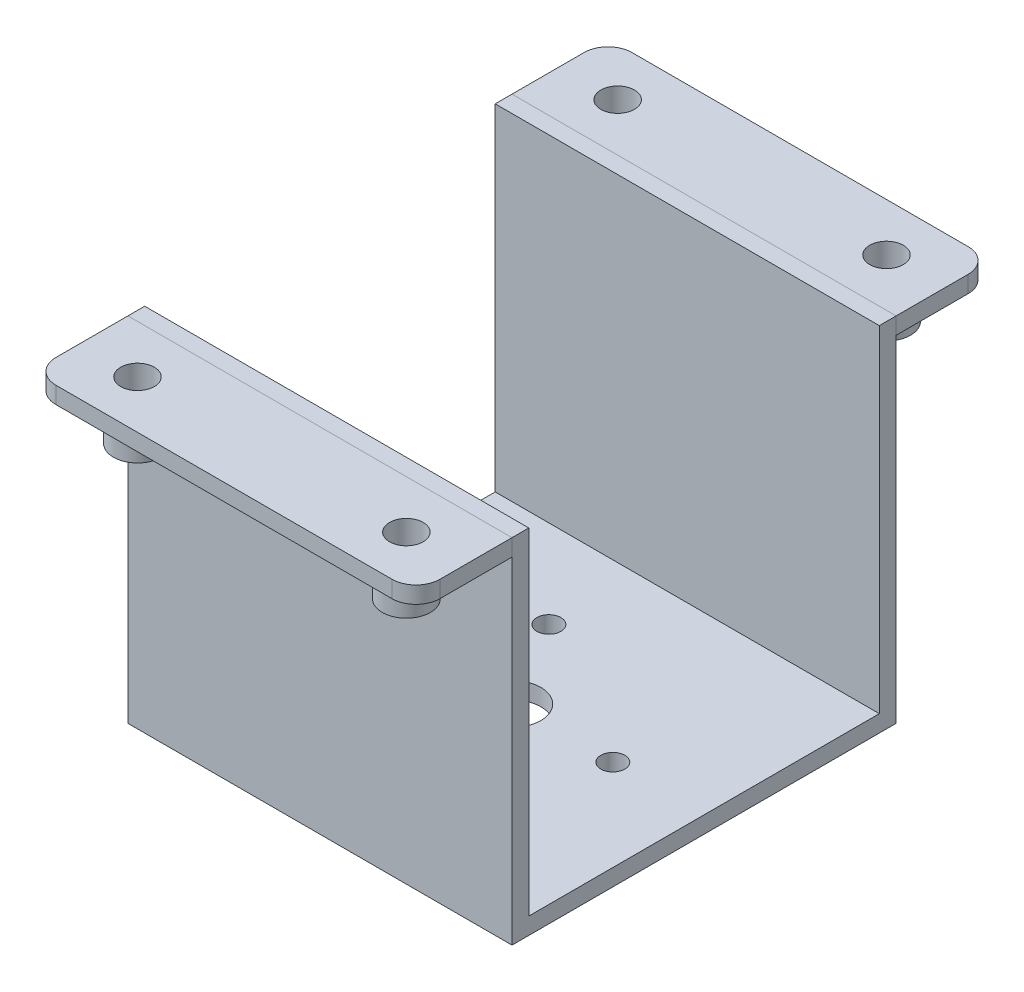
ISO-10303-21;
HEADER;
FILE_DESCRIPTION(('STEP AP214'),'2;1');
FILE_NAME('part.step','',(''),(''),'','','');
FILE_SCHEMA(('AUTOMOTIVE_DESIGN { 1 0 10303 214 1 1 1 1 }'));
ENDSEC;
DATA;
#1=APPLICATION_CONTEXT('core data for automotive mechanical design processes');
#2=APPLICATION_PROTOCOL_DEFINITION('international standard','automotive_design',2000,#1);
#3=PRODUCT_CONTEXT('',#1,'mechanical');
#4=PRODUCT('Part','Part','',(#3));
#5=PRODUCT_RELATED_PRODUCT_CATEGORY('part','',(#4));
#6=PRODUCT_DEFINITION_FORMATION('','',#4);
#7=PRODUCT_DEFINITION_CONTEXT('part definition',#1,'design');
#8=PRODUCT_DEFINITION('design','',#6,#7);
#9=PRODUCT_DEFINITION_SHAPE('','',#8);
#10=(LENGTH_UNIT() NAMED_UNIT(*) SI_UNIT(.MILLI.,.METRE.));
#11=(NAMED_UNIT(*) PLANE_ANGLE_UNIT() SI_UNIT($,.RADIAN.));
#12=(NAMED_UNIT(*) SI_UNIT($,.STERADIAN.) SOLID_ANGLE_UNIT());
#13=UNCERTAINTY_MEASURE_WITH_UNIT(LENGTH_MEASURE(1.E-05),#10,'distance_accuracy_value','');
#14=(GEOMETRIC_REPRESENTATION_CONTEXT(3) GLOBAL_UNCERTAINTY_ASSIGNED_CONTEXT((#13)) GLOBAL_UNIT_ASSIGNED_CONTEXT((#10,
#11,#12)) REPRESENTATION_CONTEXT('',''));
#15=CARTESIAN_POINT('',(0.,0.,0.));
#16=DIRECTION('',(0.,0.,1.));
#17=DIRECTION('',(1.,0.,0.));
#18=AXIS2_PLACEMENT_3D('',#15,#16,#17);
#19=CARTESIAN_POINT('',(0.,70.,0.));
#20=DIRECTION('',(0.,-1.,0.));
#21=DIRECTION('',(0.,0.,-1.));
#22=AXIS2_PLACEMENT_3D('',#19,#20,#21);
#23=PLANE('',#22);
#24=CARTESIAN_POINT('',(28.,70.,50.));
#25=DIRECTION('',(0.,-1.,0.));
#26=DIRECTION('',(0.,0.,-1.));
#27=AXIS2_PLACEMENT_3D('',#24,#25,#26);
#28=CIRCLE('',#27,5.);
#29=CARTESIAN_POINT('',(28.,70.,45.));
#30=VERTEX_POINT('',#29);
#31=EDGE_CURVE('E250',#30,#30,#28,.T.);
#32=ORIENTED_EDGE('',*,*,#31,.F.);
#33=EDGE_LOOP('',(#32));
#34=FACE_BOUND('',#33,.T.);
#35=DIRECTION('',(-1.,0.,0.));
#36=VECTOR('',#35,1.);
#37=CARTESIAN_POINT('',(0.,70.,60.));
#38=LINE('',#37,#36);
#39=CARTESIAN_POINT('',(35.,70.,60.));
#40=VERTEX_POINT('',#39);
#41=CARTESIAN_POINT('',(-35.,70.,60.));
#42=VERTEX_POINT('',#41);
#43=EDGE_CURVE('E199',#40,#42,#38,.T.);
#44=ORIENTED_EDGE('',*,*,#43,.T.);
#45=CARTESIAN_POINT('',(-35.,70.,55.));
#46=DIRECTION('',(0.,-1.,0.));
#47=DIRECTION('',(0.,0.,-1.));
#48=AXIS2_PLACEMENT_3D('',#45,#46,#47);
#49=CIRCLE('',#48,5.);
#50=CARTESIAN_POINT('',(-40.,70.,55.));
#51=VERTEX_POINT('',#50);
#52=EDGE_CURVE('E147',#42,#51,#49,.T.);
#53=ORIENTED_EDGE('',*,*,#52,.T.);
#54=DIRECTION('',(0.,0.,-1.));
#55=VECTOR('',#54,1.);
#56=CARTESIAN_POINT('',(-40.,70.,0.));
#57=LINE('',#56,#55);
#58=CARTESIAN_POINT('',(-40.,70.,40.));
#59=VERTEX_POINT('',#58);
#60=EDGE_CURVE('E205',#51,#59,#57,.T.);
#61=ORIENTED_EDGE('',*,*,#60,.T.);
#62=DIRECTION('',(1.,0.,0.));
#63=VECTOR('',#62,1.);
#64=CARTESIAN_POINT('',(0.,70.,40.));
#65=LINE('',#64,#63);
#66=CARTESIAN_POINT('',(40.,70.,40.));
#67=VERTEX_POINT('',#66);
#68=EDGE_CURVE('E200',#59,#67,#65,.T.);
#69=ORIENTED_EDGE('',*,*,#68,.T.);
#70=DIRECTION('',(0.,0.,1.));
#71=VECTOR('',#70,1.);
#72=CARTESIAN_POINT('',(40.,70.,0.));
#73=LINE('',#72,#71);
#74=CARTESIAN_POINT('',(40.,70.,55.));
#75=VERTEX_POINT('',#74);
#76=EDGE_CURVE('E191',#67,#75,#73,.T.);
#77=ORIENTED_EDGE('',*,*,#76,.T.);
#78=CARTESIAN_POINT('',(35.,70.,55.));
#79=DIRECTION('',(0.,-1.,0.));
#80=DIRECTION('',(0.,0.,-1.));
#81=AXIS2_PLACEMENT_3D('',#78,#79,#80);
#82=CIRCLE('',#81,5.);
#83=EDGE_CURVE('E230',#75,#40,#82,.T.);
#84=ORIENTED_EDGE('',*,*,#83,.T.);
#85=EDGE_LOOP('',(#44,#53,#61,#69,#77,#84));
#86=FACE_BOUND('',#85,.T.);
#87=CARTESIAN_POINT('',(-28.,70.,50.));
#88=DIRECTION('',(0.,-1.,0.));
#89=DIRECTION('',(0.,0.,-1.));
#90=AXIS2_PLACEMENT_3D('',#87,#88,#89);
#91=CIRCLE('',#90,5.);
#92=CARTESIAN_POINT('',(-28.,70.,45.));
#93=VERTEX_POINT('',#92);
#94=EDGE_CURVE('E255',#93,#93,#91,.T.);
#95=ORIENTED_EDGE('',*,*,#94,.F.);
#96=EDGE_LOOP('',(#95));
#97=FACE_BOUND('',#96,.T.);
#98=ADVANCED_FACE('F139',(#34,#86,#97),#23,.T.);
#99=CARTESIAN_POINT('',(0.,73.5,0.));
#100=DIRECTION('',(0.,-1.,0.));
#101=DIRECTION('',(0.,0.,-1.));
#102=AXIS2_PLACEMENT_3D('',#99,#100,#101);
#103=PLANE('',#102);
#104=DIRECTION('',(0.,0.,-1.));
#105=VECTOR('',#104,1.);
#106=CARTESIAN_POINT('',(-40.,73.5,0.));
#107=LINE('',#106,#105);
#108=CARTESIAN_POINT('',(-40.,73.5,55.));
#109=VERTEX_POINT('',#108);
#110=CARTESIAN_POINT('',(-40.,73.5,40.));
#111=VERTEX_POINT('',#110);
#112=EDGE_CURVE('E209',#109,#111,#107,.T.);
#113=ORIENTED_EDGE('',*,*,#112,.F.);
#114=CARTESIAN_POINT('',(-35.,73.5,55.));
#115=DIRECTION('',(0.,-1.,0.));
#116=DIRECTION('',(0.,0.,-1.));
#117=AXIS2_PLACEMENT_3D('',#114,#115,#116);
#118=CIRCLE('',#117,5.);
#119=CARTESIAN_POINT('',(-35.,73.5,60.));
#120=VERTEX_POINT('',#119);
#121=EDGE_CURVE('E224',#109,#120,#118,.F.);
#122=ORIENTED_EDGE('',*,*,#121,.T.);
#123=DIRECTION('',(-1.,0.,0.));
#124=VECTOR('',#123,1.);
#125=CARTESIAN_POINT('',(0.,73.5,60.));
#126=LINE('',#125,#124);
#127=CARTESIAN_POINT('',(35.,73.5,60.));
#128=VERTEX_POINT('',#127);
#129=EDGE_CURVE('E243',#128,#120,#126,.T.);
#130=ORIENTED_EDGE('',*,*,#129,.F.);
#131=CARTESIAN_POINT('',(35.,73.5,55.));
#132=DIRECTION('',(0.,-1.,0.));
#133=DIRECTION('',(0.,0.,-1.));
#134=AXIS2_PLACEMENT_3D('',#131,#132,#133);
#135=CIRCLE('',#134,5.);
#136=CARTESIAN_POINT('',(40.,73.5,55.));
#137=VERTEX_POINT('',#136);
#138=EDGE_CURVE('E218',#128,#137,#135,.F.);
#139=ORIENTED_EDGE('',*,*,#138,.T.);
#140=DIRECTION('',(0.,0.,1.));
#141=VECTOR('',#140,1.);
#142=CARTESIAN_POINT('',(40.,73.5,0.));
#143=LINE('',#142,#141);
#144=CARTESIAN_POINT('',(40.,73.5,40.));
#145=VERTEX_POINT('',#144);
#146=EDGE_CURVE('E246',#145,#137,#143,.T.);
#147=ORIENTED_EDGE('',*,*,#146,.F.);
#148=DIRECTION('',(1.,0.,0.));
#149=VECTOR('',#148,1.);
#150=CARTESIAN_POINT('',(0.,73.5,40.));
#151=LINE('',#150,#149);
#152=EDGE_CURVE('E213',#111,#145,#151,.T.);
#153=ORIENTED_EDGE('',*,*,#152,.F.);
#154=EDGE_LOOP('',(#113,#122,#130,#139,#147,#153));
#155=FACE_BOUND('',#154,.T.);
#156=CARTESIAN_POINT('',(28.,73.5,50.));
#157=DIRECTION('',(0.,-1.,0.));
#158=DIRECTION('',(0.,0.,-1.));
#159=AXIS2_PLACEMENT_3D('',#156,#157,#158);
#160=CIRCLE('',#159,3.5);
#161=CARTESIAN_POINT('',(28.,73.5,46.5));
#162=VERTEX_POINT('',#161);
#163=EDGE_CURVE('E262',#162,#162,#160,.T.);
#164=ORIENTED_EDGE('',*,*,#163,.T.);
#165=EDGE_LOOP('',(#164));
#166=FACE_BOUND('',#165,.T.);
#167=CARTESIAN_POINT('',(-28.,73.5,50.));
#168=DIRECTION('',(0.,-1.,0.));
#169=DIRECTION('',(0.,0.,-1.));
#170=AXIS2_PLACEMENT_3D('',#167,#168,#169);
#171=CIRCLE('',#170,3.5);
#172=CARTESIAN_POINT('',(-28.,73.5,46.5));
#173=VERTEX_POINT('',#172);
#174=EDGE_CURVE('E271',#173,#173,#171,.T.);
#175=ORIENTED_EDGE('',*,*,#174,.T.);
#176=EDGE_LOOP('',(#175));
#177=FACE_BOUND('',#176,.T.);
#178=ADVANCED_FACE('F241',(#155,#166,#177),#103,.F.);
#179=CARTESIAN_POINT('',(0.,70.,40.));
#180=DIRECTION('',(0.,0.,1.));
#181=DIRECTION('',(1.,0.,0.));
#182=AXIS2_PLACEMENT_3D('',#179,#180,#181);
#183=PLANE('',#182);
#184=ORIENTED_EDGE('',*,*,#152,.T.);
#185=DIRECTION('',(0.,1.,0.));
#186=VECTOR('',#185,1.);
#187=CARTESIAN_POINT('',(40.,70.,40.));
#188=LINE('',#187,#186);
#189=EDGE_CURVE('E195',#67,#145,#188,.T.);
#190=ORIENTED_EDGE('',*,*,#189,.F.);
#191=ORIENTED_EDGE('',*,*,#68,.F.);
#192=DIRECTION('',(0.,1.,0.));
#193=VECTOR('',#192,1.);
#194=CARTESIAN_POINT('',(-40.,70.,40.));
#195=LINE('',#194,#193);
#196=EDGE_CURVE('E215',#59,#111,#195,.T.);
#197=ORIENTED_EDGE('',*,*,#196,.T.);
#198=EDGE_LOOP('',(#184,#190,#191,#197));
#199=FACE_BOUND('',#198,.T.);
#200=ADVANCED_FACE('F211',(#199),#183,.F.);
#201=CARTESIAN_POINT('',(40.,70.,0.));
#202=DIRECTION('',(-1.,0.,0.));
#203=DIRECTION('',(0.,0.,1.));
#204=AXIS2_PLACEMENT_3D('',#201,#202,#203);
#205=PLANE('',#204);
#206=ORIENTED_EDGE('',*,*,#146,.T.);
#207=DIRECTION('',(0.,1.,0.));
#208=VECTOR('',#207,1.);
#209=CARTESIAN_POINT('',(40.,70.,55.));
#210=LINE('',#209,#208);
#211=EDGE_CURVE('E13',#137,#75,#210,.F.);
#212=ORIENTED_EDGE('',*,*,#211,.T.);
#213=ORIENTED_EDGE('',*,*,#76,.F.);
#214=ORIENTED_EDGE('',*,*,#189,.T.);
#215=EDGE_LOOP('',(#206,#212,#213,#214));
#216=FACE_BOUND('',#215,.T.);
#217=ADVANCED_FACE('F193',(#216),#205,.F.);
#218=CARTESIAN_POINT('',(0.,70.,60.));
#219=DIRECTION('',(0.,0.,-1.));
#220=DIRECTION('',(-1.,0.,0.));
#221=AXIS2_PLACEMENT_3D('',#218,#219,#220);
#222=PLANE('',#221);
#223=ORIENTED_EDGE('',*,*,#129,.T.);
#224=DIRECTION('',(0.,1.,0.));
#225=VECTOR('',#224,1.);
#226=CARTESIAN_POINT('',(-35.,70.,60.));
#227=LINE('',#226,#225);
#228=EDGE_CURVE('E160',#120,#42,#227,.F.);
#229=ORIENTED_EDGE('',*,*,#228,.T.);
#230=ORIENTED_EDGE('',*,*,#43,.F.);
#231=DIRECTION('',(0.,1.,0.));
#232=VECTOR('',#231,1.);
#233=CARTESIAN_POINT('',(35.,70.,60.));
#234=LINE('',#233,#232);
#235=EDGE_CURVE('E226',#40,#128,#234,.T.);
#236=ORIENTED_EDGE('',*,*,#235,.T.);
#237=EDGE_LOOP('',(#223,#229,#230,#236));
#238=FACE_BOUND('',#237,.T.);
#239=ADVANCED_FACE('F244',(#238),#222,.F.);
#240=CARTESIAN_POINT('',(-40.,70.,0.));
#241=DIRECTION('',(1.,0.,0.));
#242=DIRECTION('',(0.,0.,-1.));
#243=AXIS2_PLACEMENT_3D('',#240,#241,#242);
#244=PLANE('',#243);
#245=ORIENTED_EDGE('',*,*,#60,.F.);
#246=DIRECTION('',(0.,1.,0.));
#247=VECTOR('',#246,1.);
#248=CARTESIAN_POINT('',(-40.,70.,55.));
#249=LINE('',#248,#247);
#250=EDGE_CURVE('E214',#51,#109,#249,.T.);
#251=ORIENTED_EDGE('',*,*,#250,.T.);
#252=ORIENTED_EDGE('',*,*,#112,.T.);
#253=ORIENTED_EDGE('',*,*,#196,.F.);
#254=EDGE_LOOP('',(#245,#251,#252,#253));
#255=FACE_BOUND('',#254,.T.);
#256=ADVANCED_FACE('F235',(#255),#244,.F.);
#257=CARTESIAN_POINT('',(28.,61.5,50.));
#258=DIRECTION('',(0.,-1.,0.));
#259=DIRECTION('',(0.,0.,-1.));
#260=AXIS2_PLACEMENT_3D('',#257,#258,#259);
#261=PLANE('',#260);
#262=CARTESIAN_POINT('',(28.,61.5,50.));
#263=DIRECTION('',(0.,-1.,0.));
#264=DIRECTION('',(0.,0.,-1.));
#265=AXIS2_PLACEMENT_3D('',#262,#263,#264);
#266=CIRCLE('',#265,5.);
#267=CARTESIAN_POINT('',(28.,61.5,45.));
#268=VERTEX_POINT('',#267);
#269=EDGE_CURVE('E258',#268,#268,#266,.T.);
#270=ORIENTED_EDGE('',*,*,#269,.T.);
#271=EDGE_LOOP('',(#270));
#272=FACE_BOUND('',#271,.T.);
#273=CARTESIAN_POINT('',(28.,61.5,50.));
#274=DIRECTION('',(0.,-1.,0.));
#275=DIRECTION('',(0.,0.,-1.));
#276=AXIS2_PLACEMENT_3D('',#273,#274,#275);
#277=CIRCLE('',#276,3.5);
#278=CARTESIAN_POINT('',(28.,61.5,46.5));
#279=VERTEX_POINT('',#278);
#280=EDGE_CURVE('E261',#279,#279,#277,.T.);
#281=ORIENTED_EDGE('',*,*,#280,.F.);
#282=EDGE_LOOP('',(#281));
#283=FACE_BOUND('',#282,.T.);
#284=ADVANCED_FACE('F309',(#272,#283),#261,.T.);
#285=CARTESIAN_POINT('',(28.,61.5,50.));
#286=DIRECTION('',(0.,1.,0.));
#287=DIRECTION('',(0.,0.,1.));
#288=AXIS2_PLACEMENT_3D('',#285,#286,#287);
#289=CYLINDRICAL_SURFACE('',#288,5.);
#290=ORIENTED_EDGE('',*,*,#31,.T.);
#291=EDGE_LOOP('',(#290));
#292=FACE_BOUND('',#291,.T.);
#293=ORIENTED_EDGE('',*,*,#269,.F.);
#294=EDGE_LOOP('',(#293));
#295=FACE_BOUND('',#294,.T.);
#296=ADVANCED_FACE('F292',(#292,#295),#289,.T.);
#297=CARTESIAN_POINT('',(28.,61.5,50.));
#298=DIRECTION('',(0.,1.,0.));
#299=DIRECTION('',(0.,0.,1.));
#300=AXIS2_PLACEMENT_3D('',#297,#298,#299);
#301=CYLINDRICAL_SURFACE('',#300,3.5);
#302=ORIENTED_EDGE('',*,*,#280,.T.);
#303=EDGE_LOOP('',(#302));
#304=FACE_BOUND('',#303,.T.);
#305=ORIENTED_EDGE('',*,*,#163,.F.);
#306=EDGE_LOOP('',(#305));
#307=FACE_BOUND('',#306,.T.);
#308=ADVANCED_FACE('F283',(#304,#307),#301,.F.);
#309=CARTESIAN_POINT('',(-28.,61.5,50.));
#310=DIRECTION('',(0.,-1.,0.));
#311=DIRECTION('',(0.,0.,-1.));
#312=AXIS2_PLACEMENT_3D('',#309,#310,#311);
#313=PLANE('',#312);
#314=CARTESIAN_POINT('',(-28.,61.5,50.));
#315=DIRECTION('',(0.,-1.,0.));
#316=DIRECTION('',(0.,0.,-1.));
#317=AXIS2_PLACEMENT_3D('',#314,#315,#316);
#318=CIRCLE('',#317,5.);
#319=CARTESIAN_POINT('',(-28.,61.5,45.));
#320=VERTEX_POINT('',#319);
#321=EDGE_CURVE('E265',#320,#320,#318,.T.);
#322=ORIENTED_EDGE('',*,*,#321,.T.);
#323=EDGE_LOOP('',(#322));
#324=FACE_BOUND('',#323,.T.);
#325=CARTESIAN_POINT('',(-28.,61.5,50.));
#326=DIRECTION('',(0.,-1.,0.));
#327=DIRECTION('',(0.,0.,-1.));
#328=AXIS2_PLACEMENT_3D('',#325,#326,#327);
#329=CIRCLE('',#328,3.5);
#330=CARTESIAN_POINT('',(-28.,61.5,46.5));
#331=VERTEX_POINT('',#330);
#332=EDGE_CURVE('E270',#331,#331,#329,.T.);
#333=ORIENTED_EDGE('',*,*,#332,.F.);
#334=EDGE_LOOP('',(#333));
#335=FACE_BOUND('',#334,.T.);
#336=ADVANCED_FACE('F280',(#324,#335),#313,.T.);
#337=CARTESIAN_POINT('',(-28.,61.5,50.));
#338=DIRECTION('',(0.,1.,0.));
#339=DIRECTION('',(0.,0.,1.));
#340=AXIS2_PLACEMENT_3D('',#337,#338,#339);
#341=CYLINDRICAL_SURFACE('',#340,5.);
#342=ORIENTED_EDGE('',*,*,#94,.T.);
#343=EDGE_LOOP('',(#342));
#344=FACE_BOUND('',#343,.T.);
#345=ORIENTED_EDGE('',*,*,#321,.F.);
#346=EDGE_LOOP('',(#345));
#347=FACE_BOUND('',#346,.T.);
#348=ADVANCED_FACE('F282',(#344,#347),#341,.T.);
#349=CARTESIAN_POINT('',(-28.,61.5,50.));
#350=DIRECTION('',(0.,1.,0.));
#351=DIRECTION('',(0.,0.,1.));
#352=AXIS2_PLACEMENT_3D('',#349,#350,#351);
#353=CYLINDRICAL_SURFACE('',#352,3.5);
#354=ORIENTED_EDGE('',*,*,#332,.T.);
#355=EDGE_LOOP('',(#354));
#356=FACE_BOUND('',#355,.T.);
#357=ORIENTED_EDGE('',*,*,#174,.F.);
#358=EDGE_LOOP('',(#357));
#359=FACE_BOUND('',#358,.T.);
#360=ADVANCED_FACE('F277',(#356,#359),#353,.F.);
#361=CARTESIAN_POINT('',(-35.,70.,55.));
#362=DIRECTION('',(0.,1.,0.));
#363=DIRECTION('',(0.,0.,1.));
#364=AXIS2_PLACEMENT_3D('',#361,#362,#363);
#365=CYLINDRICAL_SURFACE('',#364,5.);
#366=ORIENTED_EDGE('',*,*,#52,.F.);
#367=ORIENTED_EDGE('',*,*,#228,.F.);
#368=ORIENTED_EDGE('',*,*,#121,.F.);
#369=ORIENTED_EDGE('',*,*,#250,.F.);
#370=EDGE_LOOP('',(#366,#367,#368,#369));
#371=FACE_BOUND('',#370,.T.);
#372=ADVANCED_FACE('F238',(#371),#365,.T.);
#373=CARTESIAN_POINT('',(35.,70.,55.));
#374=DIRECTION('',(0.,1.,0.));
#375=DIRECTION('',(0.,0.,1.));
#376=AXIS2_PLACEMENT_3D('',#373,#374,#375);
#377=CYLINDRICAL_SURFACE('',#376,5.);
#378=ORIENTED_EDGE('',*,*,#83,.F.);
#379=ORIENTED_EDGE('',*,*,#211,.F.);
#380=ORIENTED_EDGE('',*,*,#138,.F.);
#381=ORIENTED_EDGE('',*,*,#235,.F.);
#382=EDGE_LOOP('',(#378,#379,#380,#381));
#383=FACE_BOUND('',#382,.T.);
#384=ADVANCED_FACE('F141',(#383),#377,.T.);
#385=CLOSED_SHELL('',(#98,#178,#200,#217,#239,#256,#284,#296,#308,#336,#348,#360,#372,#384));
#386=MANIFOLD_SOLID_BREP('B2',#385);
#387=CARTESIAN_POINT('',(0.,70.,0.));
#388=DIRECTION('',(0.,1.,0.));
#389=DIRECTION('',(0.,0.,1.));
#390=AXIS2_PLACEMENT_3D('',#387,#388,#389);
#391=PLANE('',#390);
#392=DIRECTION('',(0.,0.,1.));
#393=VECTOR('',#392,1.);
#394=CARTESIAN_POINT('',(-40.,70.,0.));
#395=LINE('',#394,#393);
#396=CARTESIAN_POINT('',(-40.,70.,-55.));
#397=VERTEX_POINT('',#396);
#398=CARTESIAN_POINT('',(-40.,70.,-40.));
#399=VERTEX_POINT('',#398);
#400=EDGE_CURVE('E513',#397,#399,#395,.T.);
#401=ORIENTED_EDGE('',*,*,#400,.F.);
#402=CARTESIAN_POINT('',(-35.,70.,-55.));
#403=DIRECTION('',(0.,1.,0.));
#404=DIRECTION('',(0.,0.,1.));
#405=AXIS2_PLACEMENT_3D('',#402,#403,#404);
#406=CIRCLE('',#405,5.);
#407=CARTESIAN_POINT('',(-35.,70.,-60.));
#408=VERTEX_POINT('',#407);
#409=EDGE_CURVE('E467',#397,#408,#406,.F.);
#410=ORIENTED_EDGE('',*,*,#409,.T.);
#411=DIRECTION('',(-1.,0.,0.));
#412=VECTOR('',#411,1.);
#413=CARTESIAN_POINT('',(0.,70.,-60.));
#414=LINE('',#413,#412);
#415=CARTESIAN_POINT('',(35.,70.,-60.));
#416=VERTEX_POINT('',#415);
#417=EDGE_CURVE('E521',#416,#408,#414,.T.);
#418=ORIENTED_EDGE('',*,*,#417,.F.);
#419=CARTESIAN_POINT('',(35.,70.,-55.));
#420=DIRECTION('',(0.,1.,0.));
#421=DIRECTION('',(0.,0.,1.));
#422=AXIS2_PLACEMENT_3D('',#419,#420,#421);
#423=CIRCLE('',#422,5.);
#424=CARTESIAN_POINT('',(40.,70.,-55.));
#425=VERTEX_POINT('',#424);
#426=EDGE_CURVE('E474',#416,#425,#423,.F.);
#427=ORIENTED_EDGE('',*,*,#426,.T.);
#428=DIRECTION('',(0.,0.,-1.));
#429=VECTOR('',#428,1.);
#430=CARTESIAN_POINT('',(40.,70.,0.));
#431=LINE('',#430,#429);
#432=CARTESIAN_POINT('',(40.,70.,-40.));
#433=VERTEX_POINT('',#432);
#434=EDGE_CURVE('E529',#433,#425,#431,.T.);
#435=ORIENTED_EDGE('',*,*,#434,.F.);
#436=DIRECTION('',(1.,0.,0.));
#437=VECTOR('',#436,1.);
#438=CARTESIAN_POINT('',(0.,70.,-40.));
#439=LINE('',#438,#437);
#440=EDGE_CURVE('E520',#399,#433,#439,.T.);
#441=ORIENTED_EDGE('',*,*,#440,.F.);
#442=EDGE_LOOP('',(#401,#410,#418,#427,#435,#441));
#443=FACE_BOUND('',#442,.T.);
#444=CARTESIAN_POINT('',(-28.,70.,-50.));
#445=DIRECTION('',(0.,-1.,0.));
#446=DIRECTION('',(0.,0.,-1.));
#447=AXIS2_PLACEMENT_3D('',#444,#445,#446);
#448=CIRCLE('',#447,5.);
#449=CARTESIAN_POINT('',(-28.,70.,-55.));
#450=VERTEX_POINT('',#449);
#451=EDGE_CURVE('E540',#450,#450,#448,.T.);
#452=ORIENTED_EDGE('',*,*,#451,.F.);
#453=EDGE_LOOP('',(#452));
#454=FACE_BOUND('',#453,.T.);
#455=CARTESIAN_POINT('',(28.,70.,-50.));
#456=DIRECTION('',(0.,-1.,0.));
#457=DIRECTION('',(0.,0.,-1.));
#458=AXIS2_PLACEMENT_3D('',#455,#456,#457);
#459=CIRCLE('',#458,5.);
#460=CARTESIAN_POINT('',(28.,70.,-55.));
#461=VERTEX_POINT('',#460);
#462=EDGE_CURVE('E637',#461,#461,#459,.T.);
#463=ORIENTED_EDGE('',*,*,#462,.F.);
#464=EDGE_LOOP('',(#463));
#465=FACE_BOUND('',#464,.T.);
#466=ADVANCED_FACE('F459',(#443,#454,#465),#391,.F.);
#467=CARTESIAN_POINT('',(0.,73.5,0.));
#468=DIRECTION('',(0.,1.,0.));
#469=DIRECTION('',(0.,0.,1.));
#470=AXIS2_PLACEMENT_3D('',#467,#468,#469);
#471=PLANE('',#470);
#472=DIRECTION('',(-1.,0.,0.));
#473=VECTOR('',#472,1.);
#474=CARTESIAN_POINT('',(0.,73.5,-60.));
#475=LINE('',#474,#473);
#476=CARTESIAN_POINT('',(35.,73.5,-60.));
#477=VERTEX_POINT('',#476);
#478=CARTESIAN_POINT('',(-35.,73.5,-60.));
#479=VERTEX_POINT('',#478);
#480=EDGE_CURVE('E536',#477,#479,#475,.T.);
#481=ORIENTED_EDGE('',*,*,#480,.T.);
#482=CARTESIAN_POINT('',(-35.,73.5,-55.));
#483=DIRECTION('',(0.,1.,0.));
#484=DIRECTION('',(0.,0.,1.));
#485=AXIS2_PLACEMENT_3D('',#482,#483,#484);
#486=CIRCLE('',#485,5.);
#487=CARTESIAN_POINT('',(-40.,73.5,-55.));
#488=VERTEX_POINT('',#487);
#489=EDGE_CURVE('E554',#479,#488,#486,.T.);
#490=ORIENTED_EDGE('',*,*,#489,.T.);
#491=DIRECTION('',(0.,0.,1.));
#492=VECTOR('',#491,1.);
#493=CARTESIAN_POINT('',(-40.,73.5,0.));
#494=LINE('',#493,#492);
#495=CARTESIAN_POINT('',(-40.,73.5,-40.));
#496=VERTEX_POINT('',#495);
#497=EDGE_CURVE('E539',#488,#496,#494,.T.);
#498=ORIENTED_EDGE('',*,*,#497,.T.);
#499=DIRECTION('',(1.,0.,0.));
#500=VECTOR('',#499,1.);
#501=CARTESIAN_POINT('',(0.,73.5,-40.));
#502=LINE('',#501,#500);
#503=CARTESIAN_POINT('',(40.,73.5,-40.));
#504=VERTEX_POINT('',#503);
#505=EDGE_CURVE('E527',#496,#504,#502,.T.);
#506=ORIENTED_EDGE('',*,*,#505,.T.);
#507=DIRECTION('',(0.,0.,-1.));
#508=VECTOR('',#507,1.);
#509=CARTESIAN_POINT('',(40.,73.5,0.));
#510=LINE('',#509,#508);
#511=CARTESIAN_POINT('',(40.,73.5,-55.));
#512=VERTEX_POINT('',#511);
#513=EDGE_CURVE('E543',#504,#512,#510,.T.);
#514=ORIENTED_EDGE('',*,*,#513,.T.);
#515=CARTESIAN_POINT('',(35.,73.5,-55.));
#516=DIRECTION('',(0.,1.,0.));
#517=DIRECTION('',(0.,0.,1.));
#518=AXIS2_PLACEMENT_3D('',#515,#516,#517);
#519=CIRCLE('',#518,5.);
#520=EDGE_CURVE('E552',#512,#477,#519,.T.);
#521=ORIENTED_EDGE('',*,*,#520,.T.);
#522=EDGE_LOOP('',(#481,#490,#498,#506,#514,#521));
#523=FACE_BOUND('',#522,.T.);
#524=CARTESIAN_POINT('',(-28.,73.5,-50.));
#525=DIRECTION('',(0.,-1.,0.));
#526=DIRECTION('',(0.,0.,-1.));
#527=AXIS2_PLACEMENT_3D('',#524,#525,#526);
#528=CIRCLE('',#527,3.5);
#529=CARTESIAN_POINT('',(-28.,73.5,-53.5));
#530=VERTEX_POINT('',#529);
#531=EDGE_CURVE('E628',#530,#530,#528,.T.);
#532=ORIENTED_EDGE('',*,*,#531,.T.);
#533=EDGE_LOOP('',(#532));
#534=FACE_BOUND('',#533,.T.);
#535=CARTESIAN_POINT('',(28.,73.5,-50.));
#536=DIRECTION('',(0.,-1.,0.));
#537=DIRECTION('',(0.,0.,-1.));
#538=AXIS2_PLACEMENT_3D('',#535,#536,#537);
#539=CIRCLE('',#538,3.5);
#540=CARTESIAN_POINT('',(28.,73.5,-53.5));
#541=VERTEX_POINT('',#540);
#542=EDGE_CURVE('E620',#541,#541,#539,.T.);
#543=ORIENTED_EDGE('',*,*,#542,.T.);
#544=EDGE_LOOP('',(#543));
#545=FACE_BOUND('',#544,.T.);
#546=ADVANCED_FACE('F566',(#523,#534,#545),#471,.T.);
#547=CARTESIAN_POINT('',(0.,70.,-60.));
#548=DIRECTION('',(0.,0.,-1.));
#549=DIRECTION('',(-1.,0.,0.));
#550=AXIS2_PLACEMENT_3D('',#547,#548,#549);
#551=PLANE('',#550);
#552=ORIENTED_EDGE('',*,*,#417,.T.);
#553=DIRECTION('',(0.,1.,0.));
#554=VECTOR('',#553,1.);
#555=CARTESIAN_POINT('',(-35.,70.,-60.));
#556=LINE('',#555,#554);
#557=EDGE_CURVE('E549',#408,#479,#556,.T.);
#558=ORIENTED_EDGE('',*,*,#557,.T.);
#559=ORIENTED_EDGE('',*,*,#480,.F.);
#560=DIRECTION('',(0.,1.,0.));
#561=VECTOR('',#560,1.);
#562=CARTESIAN_POINT('',(35.,70.,-60.));
#563=LINE('',#562,#561);
#564=EDGE_CURVE('E546',#477,#416,#563,.F.);
#565=ORIENTED_EDGE('',*,*,#564,.T.);
#566=EDGE_LOOP('',(#552,#558,#559,#565));
#567=FACE_BOUND('',#566,.T.);
#568=ADVANCED_FACE('F561',(#567),#551,.T.);
#569=CARTESIAN_POINT('',(40.,70.,0.));
#570=DIRECTION('',(1.,0.,0.));
#571=DIRECTION('',(0.,0.,-1.));
#572=AXIS2_PLACEMENT_3D('',#569,#570,#571);
#573=PLANE('',#572);
#574=ORIENTED_EDGE('',*,*,#434,.T.);
#575=DIRECTION('',(0.,1.,0.));
#576=VECTOR('',#575,1.);
#577=CARTESIAN_POINT('',(40.,70.,-55.));
#578=LINE('',#577,#576);
#579=EDGE_CURVE('E137',#425,#512,#578,.T.);
#580=ORIENTED_EDGE('',*,*,#579,.T.);
#581=ORIENTED_EDGE('',*,*,#513,.F.);
#582=DIRECTION('',(0.,1.,0.));
#583=VECTOR('',#582,1.);
#584=CARTESIAN_POINT('',(40.,70.,-40.));
#585=LINE('',#584,#583);
#586=EDGE_CURVE('E528',#433,#504,#585,.T.);
#587=ORIENTED_EDGE('',*,*,#586,.F.);
#588=EDGE_LOOP('',(#574,#580,#581,#587));
#589=FACE_BOUND('',#588,.T.);
#590=ADVANCED_FACE('F572',(#589),#573,.T.);
#591=CARTESIAN_POINT('',(0.,70.,-40.));
#592=DIRECTION('',(0.,0.,1.));
#593=DIRECTION('',(1.,0.,0.));
#594=AXIS2_PLACEMENT_3D('',#591,#592,#593);
#595=PLANE('',#594);
#596=ORIENTED_EDGE('',*,*,#505,.F.);
#597=DIRECTION('',(0.,1.,0.));
#598=VECTOR('',#597,1.);
#599=CARTESIAN_POINT('',(-40.,70.,-40.));
#600=LINE('',#599,#598);
#601=EDGE_CURVE('E516',#399,#496,#600,.T.);
#602=ORIENTED_EDGE('',*,*,#601,.F.);
#603=ORIENTED_EDGE('',*,*,#440,.T.);
#604=ORIENTED_EDGE('',*,*,#586,.T.);
#605=EDGE_LOOP('',(#596,#602,#603,#604));
#606=FACE_BOUND('',#605,.T.);
#607=ADVANCED_FACE('F525',(#606),#595,.T.);
#608=CARTESIAN_POINT('',(-40.,70.,0.));
#609=DIRECTION('',(-1.,0.,0.));
#610=DIRECTION('',(0.,0.,1.));
#611=AXIS2_PLACEMENT_3D('',#608,#609,#610);
#612=PLANE('',#611);
#613=ORIENTED_EDGE('',*,*,#497,.F.);
#614=DIRECTION('',(0.,1.,0.));
#615=VECTOR('',#614,1.);
#616=CARTESIAN_POINT('',(-40.,70.,-55.));
#617=LINE('',#616,#615);
#618=EDGE_CURVE('E482',#488,#397,#617,.F.);
#619=ORIENTED_EDGE('',*,*,#618,.T.);
#620=ORIENTED_EDGE('',*,*,#400,.T.);
#621=ORIENTED_EDGE('',*,*,#601,.T.);
#622=EDGE_LOOP('',(#613,#619,#620,#621));
#623=FACE_BOUND('',#622,.T.);
#624=ADVANCED_FACE('F515',(#623),#612,.T.);
#625=CARTESIAN_POINT('',(-28.,61.5,-50.));
#626=DIRECTION('',(0.,1.,0.));
#627=DIRECTION('',(0.,0.,1.));
#628=AXIS2_PLACEMENT_3D('',#625,#626,#627);
#629=CYLINDRICAL_SURFACE('',#628,5.);
#630=CARTESIAN_POINT('',(-28.,61.5,-50.));
#631=DIRECTION('',(0.,-1.,0.));
#632=DIRECTION('',(0.,0.,-1.));
#633=AXIS2_PLACEMENT_3D('',#630,#631,#632);
#634=CIRCLE('',#633,5.);
#635=CARTESIAN_POINT('',(-28.,61.5,-55.));
#636=VERTEX_POINT('',#635);
#637=EDGE_CURVE('E632',#636,#636,#634,.T.);
#638=ORIENTED_EDGE('',*,*,#637,.F.);
#639=EDGE_LOOP('',(#638));
#640=FACE_BOUND('',#639,.T.);
#641=ORIENTED_EDGE('',*,*,#451,.T.);
#642=EDGE_LOOP('',(#641));
#643=FACE_BOUND('',#642,.T.);
#644=ADVANCED_FACE('F588',(#640,#643),#629,.T.);
#645=CARTESIAN_POINT('',(-28.,61.5,-50.));
#646=DIRECTION('',(0.,-1.,0.));
#647=DIRECTION('',(0.,0.,-1.));
#648=AXIS2_PLACEMENT_3D('',#645,#646,#647);
#649=PLANE('',#648);
#650=ORIENTED_EDGE('',*,*,#637,.T.);
#651=EDGE_LOOP('',(#650));
#652=FACE_BOUND('',#651,.T.);
#653=CARTESIAN_POINT('',(-28.,61.5,-50.));
#654=DIRECTION('',(0.,-1.,0.));
#655=DIRECTION('',(0.,0.,-1.));
#656=AXIS2_PLACEMENT_3D('',#653,#654,#655);
#657=CIRCLE('',#656,3.5);
#658=CARTESIAN_POINT('',(-28.,61.5,-53.5));
#659=VERTEX_POINT('',#658);
#660=EDGE_CURVE('E629',#659,#659,#657,.T.);
#661=ORIENTED_EDGE('',*,*,#660,.F.);
#662=EDGE_LOOP('',(#661));
#663=FACE_BOUND('',#662,.T.);
#664=ADVANCED_FACE('F591',(#652,#663),#649,.T.);
#665=CARTESIAN_POINT('',(-28.,61.5,-50.));
#666=DIRECTION('',(0.,1.,0.));
#667=DIRECTION('',(0.,0.,1.));
#668=AXIS2_PLACEMENT_3D('',#665,#666,#667);
#669=CYLINDRICAL_SURFACE('',#668,3.5);
#670=ORIENTED_EDGE('',*,*,#660,.T.);
#671=EDGE_LOOP('',(#670));
#672=FACE_BOUND('',#671,.T.);
#673=ORIENTED_EDGE('',*,*,#531,.F.);
#674=EDGE_LOOP('',(#673));
#675=FACE_BOUND('',#674,.T.);
#676=ADVANCED_FACE('F595',(#672,#675),#669,.F.);
#677=CARTESIAN_POINT('',(28.,61.5,-50.));
#678=DIRECTION('',(0.,1.,0.));
#679=DIRECTION('',(0.,0.,1.));
#680=AXIS2_PLACEMENT_3D('',#677,#678,#679);
#681=CYLINDRICAL_SURFACE('',#680,5.);
#682=CARTESIAN_POINT('',(28.,61.5,-50.));
#683=DIRECTION('',(0.,-1.,0.));
#684=DIRECTION('',(0.,0.,-1.));
#685=AXIS2_PLACEMENT_3D('',#682,#683,#684);
#686=CIRCLE('',#685,5.);
#687=CARTESIAN_POINT('',(28.,61.5,-55.));
#688=VERTEX_POINT('',#687);
#689=EDGE_CURVE('E623',#688,#688,#686,.T.);
#690=ORIENTED_EDGE('',*,*,#689,.F.);
#691=EDGE_LOOP('',(#690));
#692=FACE_BOUND('',#691,.T.);
#693=ORIENTED_EDGE('',*,*,#462,.T.);
#694=EDGE_LOOP('',(#693));
#695=FACE_BOUND('',#694,.T.);
#696=ADVANCED_FACE('F599',(#692,#695),#681,.T.);
#697=CARTESIAN_POINT('',(28.,61.5,-50.));
#698=DIRECTION('',(0.,-1.,0.));
#699=DIRECTION('',(0.,0.,-1.));
#700=AXIS2_PLACEMENT_3D('',#697,#698,#699);
#701=PLANE('',#700);
#702=ORIENTED_EDGE('',*,*,#689,.T.);
#703=EDGE_LOOP('',(#702));
#704=FACE_BOUND('',#703,.T.);
#705=CARTESIAN_POINT('',(28.,61.5,-50.));
#706=DIRECTION('',(0.,-1.,0.));
#707=DIRECTION('',(0.,0.,-1.));
#708=AXIS2_PLACEMENT_3D('',#705,#706,#707);
#709=CIRCLE('',#708,3.5);
#710=CARTESIAN_POINT('',(28.,61.5,-53.5));
#711=VERTEX_POINT('',#710);
#712=EDGE_CURVE('E617',#711,#711,#709,.T.);
#713=ORIENTED_EDGE('',*,*,#712,.F.);
#714=EDGE_LOOP('',(#713));
#715=FACE_BOUND('',#714,.T.);
#716=ADVANCED_FACE('F603',(#704,#715),#701,.T.);
#717=CARTESIAN_POINT('',(28.,61.5,-50.));
#718=DIRECTION('',(0.,1.,0.));
#719=DIRECTION('',(0.,0.,1.));
#720=AXIS2_PLACEMENT_3D('',#717,#718,#719);
#721=CYLINDRICAL_SURFACE('',#720,3.5);
#722=ORIENTED_EDGE('',*,*,#712,.T.);
#723=EDGE_LOOP('',(#722));
#724=FACE_BOUND('',#723,.T.);
#725=ORIENTED_EDGE('',*,*,#542,.F.);
#726=EDGE_LOOP('',(#725));
#727=FACE_BOUND('',#726,.T.);
#728=ADVANCED_FACE('F607',(#724,#727),#721,.F.);
#729=CARTESIAN_POINT('',(-35.,70.,-55.));
#730=DIRECTION('',(0.,1.,0.));
#731=DIRECTION('',(0.,0.,1.));
#732=AXIS2_PLACEMENT_3D('',#729,#730,#731);
#733=CYLINDRICAL_SURFACE('',#732,5.);
#734=ORIENTED_EDGE('',*,*,#409,.F.);
#735=ORIENTED_EDGE('',*,*,#618,.F.);
#736=ORIENTED_EDGE('',*,*,#489,.F.);
#737=ORIENTED_EDGE('',*,*,#557,.F.);
#738=EDGE_LOOP('',(#734,#735,#736,#737));
#739=FACE_BOUND('',#738,.T.);
#740=ADVANCED_FACE('F564',(#739),#733,.T.);
#741=CARTESIAN_POINT('',(35.,70.,-55.));
#742=DIRECTION('',(0.,1.,0.));
#743=DIRECTION('',(0.,0.,1.));
#744=AXIS2_PLACEMENT_3D('',#741,#742,#743);
#745=CYLINDRICAL_SURFACE('',#744,5.);
#746=ORIENTED_EDGE('',*,*,#426,.F.);
#747=ORIENTED_EDGE('',*,*,#564,.F.);
#748=ORIENTED_EDGE('',*,*,#520,.F.);
#749=ORIENTED_EDGE('',*,*,#579,.F.);
#750=EDGE_LOOP('',(#746,#747,#748,#749));
#751=FACE_BOUND('',#750,.T.);
#752=ADVANCED_FACE('F461',(#751),#745,.T.);
#753=CLOSED_SHELL('',(#466,#546,#568,#590,#607,#624,#644,#664,#676,#696,#716,#728,#740,#752));
#754=MANIFOLD_SOLID_BREP('B7',#753);
#755=CARTESIAN_POINT('',(0.,3.5,0.));
#756=DIRECTION('',(0.,1.,0.));
#757=DIRECTION('',(0.,0.,1.));
#758=AXIS2_PLACEMENT_3D('',#755,#756,#757);
#759=PLANE('',#758);
#760=CARTESIAN_POINT('',(-10.5000000000001,3.5,18.1865334794732));
#761=DIRECTION('',(0.,1.,0.));
#762=DIRECTION('',(0.,0.,1.));
#763=AXIS2_PLACEMENT_3D('',#760,#761,#762);
#764=CIRCLE('',#763,2.5);
#765=CARTESIAN_POINT('',(-10.5000000000001,3.5,20.6865334794732));
#766=VERTEX_POINT('',#765);
#767=EDGE_CURVE('E904',#766,#766,#764,.T.);
#768=ORIENTED_EDGE('',*,*,#767,.F.);
#769=EDGE_LOOP('',(#768));
#770=FACE_BOUND('',#769,.T.);
#771=CARTESIAN_POINT('',(21.,3.5,0.));
#772=DIRECTION('',(0.,1.,0.));
#773=DIRECTION('',(0.,0.,1.));
#774=AXIS2_PLACEMENT_3D('',#771,#772,#773);
#775=CIRCLE('',#774,2.5);
#776=CARTESIAN_POINT('',(21.,3.5,2.5));
#777=VERTEX_POINT('',#776);
#778=EDGE_CURVE('E908',#777,#777,#775,.T.);
#779=ORIENTED_EDGE('',*,*,#778,.F.);
#780=EDGE_LOOP('',(#779));
#781=FACE_BOUND('',#780,.T.);
#782=CARTESIAN_POINT('',(0.,3.5,0.));
#783=DIRECTION('',(0.,1.,0.));
#784=DIRECTION('',(0.,0.,1.));
#785=AXIS2_PLACEMENT_3D('',#782,#783,#784);
#786=CIRCLE('',#785,6.);
#787=CARTESIAN_POINT('',(0.,3.5,6.));
#788=VERTEX_POINT('',#787);
#789=EDGE_CURVE('E912',#788,#788,#786,.T.);
#790=ORIENTED_EDGE('',*,*,#789,.F.);
#791=EDGE_LOOP('',(#790));
#792=FACE_BOUND('',#791,.T.);
#793=CARTESIAN_POINT('',(-10.4999999999998,3.5,-18.1865334794733));
#794=DIRECTION('',(0.,1.,0.));
#795=DIRECTION('',(0.,0.,1.));
#796=AXIS2_PLACEMENT_3D('',#793,#794,#795);
#797=CIRCLE('',#796,2.5);
#798=CARTESIAN_POINT('',(-10.4999999999998,3.5,-15.6865334794733));
#799=VERTEX_POINT('',#798);
#800=EDGE_CURVE('E916',#799,#799,#797,.T.);
#801=ORIENTED_EDGE('',*,*,#800,.F.);
#802=EDGE_LOOP('',(#801));
#803=FACE_BOUND('',#802,.T.);
#804=DIRECTION('',(0.,0.,1.));
#805=VECTOR('',#804,1.);
#806=CARTESIAN_POINT('',(-40.,3.5,0.));
#807=LINE('',#806,#805);
#808=CARTESIAN_POINT('',(-40.,3.5,-36.5));
#809=VERTEX_POINT('',#808);
#810=CARTESIAN_POINT('',(-40.,3.5,36.5));
#811=VERTEX_POINT('',#810);
#812=EDGE_CURVE('E791',#809,#811,#807,.T.);
#813=ORIENTED_EDGE('',*,*,#812,.T.);
#814=DIRECTION('',(-1.,0.,0.));
#815=VECTOR('',#814,1.);
#816=CARTESIAN_POINT('',(0.,3.5,36.5));
#817=LINE('',#816,#815);
#818=CARTESIAN_POINT('',(40.,3.5,36.5));
#819=VERTEX_POINT('',#818);
#820=EDGE_CURVE('E786',#819,#811,#817,.T.);
#821=ORIENTED_EDGE('',*,*,#820,.F.);
#822=DIRECTION('',(0.,0.,-1.));
#823=VECTOR('',#822,1.);
#824=CARTESIAN_POINT('',(40.,3.5,0.));
#825=LINE('',#824,#823);
#826=CARTESIAN_POINT('',(40.,3.5,-36.5));
#827=VERTEX_POINT('',#826);
#828=EDGE_CURVE('E898',#819,#827,#825,.T.);
#829=ORIENTED_EDGE('',*,*,#828,.T.);
#830=DIRECTION('',(-1.,0.,0.));
#831=VECTOR('',#830,1.);
#832=CARTESIAN_POINT('',(0.,3.5,-36.5));
#833=LINE('',#832,#831);
#834=EDGE_CURVE('E870',#827,#809,#833,.T.);
#835=ORIENTED_EDGE('',*,*,#834,.T.);
#836=EDGE_LOOP('',(#813,#821,#829,#835));
#837=FACE_BOUND('',#836,.T.);
#838=ADVANCED_FACE('F770',(#770,#781,#792,#803,#837),#759,.T.);
#839=CARTESIAN_POINT('',(0.,3.5,40.));
#840=DIRECTION('',(0.,0.,-1.));
#841=DIRECTION('',(-1.,0.,0.));
#842=AXIS2_PLACEMENT_3D('',#839,#840,#841);
#843=PLANE('',#842);
#844=DIRECTION('',(1.,0.,0.));
#845=VECTOR('',#844,1.);
#846=CARTESIAN_POINT('',(0.,0.,40.));
#847=LINE('',#846,#845);
#848=CARTESIAN_POINT('',(-40.,0.,40.));
#849=VERTEX_POINT('',#848);
#850=CARTESIAN_POINT('',(40.,0.,40.));
#851=VERTEX_POINT('',#850);
#852=EDGE_CURVE('E840',#849,#851,#847,.T.);
#853=ORIENTED_EDGE('',*,*,#852,.T.);
#854=DIRECTION('',(0.,-1.,0.));
#855=VECTOR('',#854,1.);
#856=CARTESIAN_POINT('',(40.,3.5,40.));
#857=LINE('',#856,#855);
#858=CARTESIAN_POINT('',(40.,73.5,40.));
#859=VERTEX_POINT('',#858);
#860=EDGE_CURVE('E457',#859,#851,#857,.T.);
#861=ORIENTED_EDGE('',*,*,#860,.F.);
#862=DIRECTION('',(-1.,0.,0.));
#863=VECTOR('',#862,1.);
#864=CARTESIAN_POINT('',(0.,73.5,40.));
#865=LINE('',#864,#863);
#866=CARTESIAN_POINT('',(-40.,73.5,40.));
#867=VERTEX_POINT('',#866);
#868=EDGE_CURVE('E838',#859,#867,#865,.T.);
#869=ORIENTED_EDGE('',*,*,#868,.T.);
#870=DIRECTION('',(0.,-1.,0.));
#871=VECTOR('',#870,1.);
#872=CARTESIAN_POINT('',(-40.,3.5,40.));
#873=LINE('',#872,#871);
#874=EDGE_CURVE('E920',#867,#849,#873,.T.);
#875=ORIENTED_EDGE('',*,*,#874,.T.);
#876=EDGE_LOOP('',(#853,#861,#869,#875));
#877=FACE_BOUND('',#876,.T.);
#878=ADVANCED_FACE('F772',(#877),#843,.F.);
#879=CARTESIAN_POINT('',(40.,3.5,0.));
#880=DIRECTION('',(-1.,0.,0.));
#881=DIRECTION('',(0.,0.,1.));
#882=AXIS2_PLACEMENT_3D('',#879,#880,#881);
#883=PLANE('',#882);
#884=DIRECTION('',(0.,0.,-1.));
#885=VECTOR('',#884,1.);
#886=CARTESIAN_POINT('',(40.,0.,0.));
#887=LINE('',#886,#885);
#888=CARTESIAN_POINT('',(40.,0.,-40.));
#889=VERTEX_POINT('',#888);
#890=EDGE_CURVE('E923',#851,#889,#887,.T.);
#891=ORIENTED_EDGE('',*,*,#890,.T.);
#892=DIRECTION('',(0.,-1.,0.));
#893=VECTOR('',#892,1.);
#894=CARTESIAN_POINT('',(40.,3.5,-40.));
#895=LINE('',#894,#893);
#896=CARTESIAN_POINT('',(40.,73.5,-40.));
#897=VERTEX_POINT('',#896);
#898=EDGE_CURVE('E779',#897,#889,#895,.T.);
#899=ORIENTED_EDGE('',*,*,#898,.F.);
#900=DIRECTION('',(0.,0.,1.));
#901=VECTOR('',#900,1.);
#902=CARTESIAN_POINT('',(40.,73.5,0.));
#903=LINE('',#902,#901);
#904=CARTESIAN_POINT('',(40.,73.5,-36.5));
#905=VERTEX_POINT('',#904);
#906=EDGE_CURVE('E873',#897,#905,#903,.T.);
#907=ORIENTED_EDGE('',*,*,#906,.T.);
#908=DIRECTION('',(0.,-1.,0.));
#909=VECTOR('',#908,1.);
#910=CARTESIAN_POINT('',(40.,73.5,-36.5));
#911=LINE('',#910,#909);
#912=EDGE_CURVE('E889',#905,#827,#911,.T.);
#913=ORIENTED_EDGE('',*,*,#912,.T.);
#914=ORIENTED_EDGE('',*,*,#828,.F.);
#915=DIRECTION('',(0.,-1.,0.));
#916=VECTOR('',#915,1.);
#917=CARTESIAN_POINT('',(40.,73.5,36.5));
#918=LINE('',#917,#916);
#919=CARTESIAN_POINT('',(40.,73.5,36.5));
#920=VERTEX_POINT('',#919);
#921=EDGE_CURVE('E855',#920,#819,#918,.T.);
#922=ORIENTED_EDGE('',*,*,#921,.F.);
#923=DIRECTION('',(0.,0.,1.));
#924=VECTOR('',#923,1.);
#925=CARTESIAN_POINT('',(40.,73.5,0.));
#926=LINE('',#925,#924);
#927=EDGE_CURVE('E848',#920,#859,#926,.T.);
#928=ORIENTED_EDGE('',*,*,#927,.T.);
#929=ORIENTED_EDGE('',*,*,#860,.T.);
#930=EDGE_LOOP('',(#891,#899,#907,#913,#914,#922,#928,#929));
#931=FACE_BOUND('',#930,.T.);
#932=ADVANCED_FACE('F853',(#931),#883,.F.);
#933=CARTESIAN_POINT('',(0.,3.5,-40.));
#934=DIRECTION('',(0.,0.,-1.));
#935=DIRECTION('',(-1.,0.,0.));
#936=AXIS2_PLACEMENT_3D('',#933,#934,#935);
#937=PLANE('',#936);
#938=DIRECTION('',(1.,0.,0.));
#939=VECTOR('',#938,1.);
#940=CARTESIAN_POINT('',(0.,0.,-40.));
#941=LINE('',#940,#939);
#942=CARTESIAN_POINT('',(-40.,0.,-40.));
#943=VERTEX_POINT('',#942);
#944=EDGE_CURVE('E926',#943,#889,#941,.T.);
#945=ORIENTED_EDGE('',*,*,#944,.F.);
#946=DIRECTION('',(0.,-1.,0.));
#947=VECTOR('',#946,1.);
#948=CARTESIAN_POINT('',(-40.,3.5,-40.));
#949=LINE('',#948,#947);
#950=CARTESIAN_POINT('',(-40.,73.5,-40.));
#951=VERTEX_POINT('',#950);
#952=EDGE_CURVE('E950',#951,#943,#949,.T.);
#953=ORIENTED_EDGE('',*,*,#952,.F.);
#954=DIRECTION('',(-1.,0.,0.));
#955=VECTOR('',#954,1.);
#956=CARTESIAN_POINT('',(0.,73.5,-40.));
#957=LINE('',#956,#955);
#958=EDGE_CURVE('E885',#897,#951,#957,.T.);
#959=ORIENTED_EDGE('',*,*,#958,.F.);
#960=ORIENTED_EDGE('',*,*,#898,.T.);
#961=EDGE_LOOP('',(#945,#953,#959,#960));
#962=FACE_BOUND('',#961,.T.);
#963=ADVANCED_FACE('F956',(#962),#937,.T.);
#964=CARTESIAN_POINT('',(0.,3.5,0.));
#965=DIRECTION('',(0.,-1.,0.));
#966=DIRECTION('',(0.,0.,-1.));
#967=AXIS2_PLACEMENT_3D('',#964,#965,#966);
#968=CYLINDRICAL_SURFACE('',#967,6.);
#969=ORIENTED_EDGE('',*,*,#789,.T.);
#970=EDGE_LOOP('',(#969));
#971=FACE_BOUND('',#970,.T.);
#972=CARTESIAN_POINT('',(0.,0.,0.));
#973=DIRECTION('',(0.,1.,0.));
#974=DIRECTION('',(0.,0.,1.));
#975=AXIS2_PLACEMENT_3D('',#972,#973,#974);
#976=CIRCLE('',#975,6.);
#977=CARTESIAN_POINT('',(0.,0.,6.));
#978=VERTEX_POINT('',#977);
#979=EDGE_CURVE('E941',#978,#978,#976,.T.);
#980=ORIENTED_EDGE('',*,*,#979,.F.);
#981=EDGE_LOOP('',(#980));
#982=FACE_BOUND('',#981,.T.);
#983=ADVANCED_FACE('F998',(#971,#982),#968,.F.);
#984=CARTESIAN_POINT('',(21.,3.5,0.));
#985=DIRECTION('',(0.,-1.,0.));
#986=DIRECTION('',(0.,0.,-1.));
#987=AXIS2_PLACEMENT_3D('',#984,#985,#986);
#988=CYLINDRICAL_SURFACE('',#987,2.5);
#989=ORIENTED_EDGE('',*,*,#778,.T.);
#990=EDGE_LOOP('',(#989));
#991=FACE_BOUND('',#990,.T.);
#992=CARTESIAN_POINT('',(21.,0.,0.));
#993=DIRECTION('',(0.,1.,0.));
#994=DIRECTION('',(0.,0.,1.));
#995=AXIS2_PLACEMENT_3D('',#992,#993,#994);
#996=CIRCLE('',#995,2.5);
#997=CARTESIAN_POINT('',(21.,0.,2.5));
#998=VERTEX_POINT('',#997);
#999=EDGE_CURVE('E937',#998,#998,#996,.T.);
#1000=ORIENTED_EDGE('',*,*,#999,.F.);
#1001=EDGE_LOOP('',(#1000));
#1002=FACE_BOUND('',#1001,.T.);
#1003=ADVANCED_FACE('F1001',(#991,#1002),#988,.F.);
#1004=CARTESIAN_POINT('',(-10.5000000000001,3.5,18.1865334794732));
#1005=DIRECTION('',(0.,-1.,0.));
#1006=DIRECTION('',(0.,0.,-1.));
#1007=AXIS2_PLACEMENT_3D('',#1004,#1005,#1006);
#1008=CYLINDRICAL_SURFACE('',#1007,2.5);
#1009=ORIENTED_EDGE('',*,*,#767,.T.);
#1010=EDGE_LOOP('',(#1009));
#1011=FACE_BOUND('',#1010,.T.);
#1012=CARTESIAN_POINT('',(-10.5000000000001,0.,18.1865334794732));
#1013=DIRECTION('',(0.,1.,0.));
#1014=DIRECTION('',(0.,0.,1.));
#1015=AXIS2_PLACEMENT_3D('',#1012,#1013,#1014);
#1016=CIRCLE('',#1015,2.5);
#1017=CARTESIAN_POINT('',(-10.5000000000001,0.,20.6865334794732));
#1018=VERTEX_POINT('',#1017);
#1019=EDGE_CURVE('E933',#1018,#1018,#1016,.T.);
#1020=ORIENTED_EDGE('',*,*,#1019,.F.);
#1021=EDGE_LOOP('',(#1020));
#1022=FACE_BOUND('',#1021,.T.);
#1023=ADVANCED_FACE('F1005',(#1011,#1022),#1008,.F.);
#1024=CARTESIAN_POINT('',(-40.,3.5,0.));
#1025=DIRECTION('',(1.,0.,0.));
#1026=DIRECTION('',(0.,0.,-1.));
#1027=AXIS2_PLACEMENT_3D('',#1024,#1025,#1026);
#1028=PLANE('',#1027);
#1029=DIRECTION('',(0.,0.,1.));
#1030=VECTOR('',#1029,1.);
#1031=CARTESIAN_POINT('',(-40.,0.,0.));
#1032=LINE('',#1031,#1030);
#1033=EDGE_CURVE('E930',#943,#849,#1032,.T.);
#1034=ORIENTED_EDGE('',*,*,#1033,.T.);
#1035=ORIENTED_EDGE('',*,*,#874,.F.);
#1036=DIRECTION('',(0.,0.,-1.));
#1037=VECTOR('',#1036,1.);
#1038=CARTESIAN_POINT('',(-40.,73.5,0.));
#1039=LINE('',#1038,#1037);
#1040=CARTESIAN_POINT('',(-40.,73.5,36.5));
#1041=VERTEX_POINT('',#1040);
#1042=EDGE_CURVE('E850',#867,#1041,#1039,.T.);
#1043=ORIENTED_EDGE('',*,*,#1042,.T.);
#1044=DIRECTION('',(0.,-1.,0.));
#1045=VECTOR('',#1044,1.);
#1046=CARTESIAN_POINT('',(-40.,73.5,36.5));
#1047=LINE('',#1046,#1045);
#1048=EDGE_CURVE('E866',#1041,#811,#1047,.T.);
#1049=ORIENTED_EDGE('',*,*,#1048,.T.);
#1050=ORIENTED_EDGE('',*,*,#812,.F.);
#1051=DIRECTION('',(0.,-1.,0.));
#1052=VECTOR('',#1051,1.);
#1053=CARTESIAN_POINT('',(-40.,73.5,-36.5));
#1054=LINE('',#1053,#1052);
#1055=CARTESIAN_POINT('',(-40.,73.5,-36.5));
#1056=VERTEX_POINT('',#1055);
#1057=EDGE_CURVE('E892',#1056,#809,#1054,.T.);
#1058=ORIENTED_EDGE('',*,*,#1057,.F.);
#1059=DIRECTION('',(0.,0.,-1.));
#1060=VECTOR('',#1059,1.);
#1061=CARTESIAN_POINT('',(-40.,73.5,0.));
#1062=LINE('',#1061,#1060);
#1063=EDGE_CURVE('E881',#1056,#951,#1062,.T.);
#1064=ORIENTED_EDGE('',*,*,#1063,.T.);
#1065=ORIENTED_EDGE('',*,*,#952,.T.);
#1066=EDGE_LOOP('',(#1034,#1035,#1043,#1049,#1050,#1058,#1064,#1065));
#1067=FACE_BOUND('',#1066,.T.);
#1068=ADVANCED_FACE('F963',(#1067),#1028,.F.);
#1069=CARTESIAN_POINT('',(-10.4999999999998,3.5,-18.1865334794733));
#1070=DIRECTION('',(0.,-1.,0.));
#1071=DIRECTION('',(0.,0.,-1.));
#1072=AXIS2_PLACEMENT_3D('',#1069,#1070,#1071);
#1073=CYLINDRICAL_SURFACE('',#1072,2.5);
#1074=ORIENTED_EDGE('',*,*,#800,.T.);
#1075=EDGE_LOOP('',(#1074));
#1076=FACE_BOUND('',#1075,.T.);
#1077=CARTESIAN_POINT('',(-10.4999999999998,0.,-18.1865334794733));
#1078=DIRECTION('',(0.,1.,0.));
#1079=DIRECTION('',(0.,0.,1.));
#1080=AXIS2_PLACEMENT_3D('',#1077,#1078,#1079);
#1081=CIRCLE('',#1080,2.5);
#1082=CARTESIAN_POINT('',(-10.4999999999998,0.,-15.6865334794733));
#1083=VERTEX_POINT('',#1082);
#1084=EDGE_CURVE('E901',#1083,#1083,#1081,.T.);
#1085=ORIENTED_EDGE('',*,*,#1084,.F.);
#1086=EDGE_LOOP('',(#1085));
#1087=FACE_BOUND('',#1086,.T.);
#1088=ADVANCED_FACE('F994',(#1076,#1087),#1073,.F.);
#1089=CARTESIAN_POINT('',(0.,0.,0.));
#1090=DIRECTION('',(0.,1.,0.));
#1091=DIRECTION('',(0.,0.,1.));
#1092=AXIS2_PLACEMENT_3D('',#1089,#1090,#1091);
#1093=PLANE('',#1092);
#1094=ORIENTED_EDGE('',*,*,#852,.F.);
#1095=ORIENTED_EDGE('',*,*,#1033,.F.);
#1096=ORIENTED_EDGE('',*,*,#944,.T.);
#1097=ORIENTED_EDGE('',*,*,#890,.F.);
#1098=EDGE_LOOP('',(#1094,#1095,#1096,#1097));
#1099=FACE_BOUND('',#1098,.T.);
#1100=ORIENTED_EDGE('',*,*,#1019,.T.);
#1101=EDGE_LOOP('',(#1100));
#1102=FACE_BOUND('',#1101,.T.);
#1103=ORIENTED_EDGE('',*,*,#999,.T.);
#1104=EDGE_LOOP('',(#1103));
#1105=FACE_BOUND('',#1104,.T.);
#1106=ORIENTED_EDGE('',*,*,#979,.T.);
#1107=EDGE_LOOP('',(#1106));
#1108=FACE_BOUND('',#1107,.T.);
#1109=ORIENTED_EDGE('',*,*,#1084,.T.);
#1110=EDGE_LOOP('',(#1109));
#1111=FACE_BOUND('',#1110,.T.);
#1112=ADVANCED_FACE('F960',(#1099,#1102,#1105,#1108,#1111),#1093,.F.);
#1113=CARTESIAN_POINT('',(0.,73.5,-36.5));
#1114=DIRECTION('',(0.,0.,1.));
#1115=DIRECTION('',(1.,0.,0.));
#1116=AXIS2_PLACEMENT_3D('',#1113,#1114,#1115);
#1117=PLANE('',#1116);
#1118=ORIENTED_EDGE('',*,*,#834,.F.);
#1119=ORIENTED_EDGE('',*,*,#912,.F.);
#1120=DIRECTION('',(-1.,0.,0.));
#1121=VECTOR('',#1120,1.);
#1122=CARTESIAN_POINT('',(0.,73.5,-36.5));
#1123=LINE('',#1122,#1121);
#1124=EDGE_CURVE('E877',#905,#1056,#1123,.T.);
#1125=ORIENTED_EDGE('',*,*,#1124,.T.);
#1126=ORIENTED_EDGE('',*,*,#1057,.T.);
#1127=EDGE_LOOP('',(#1118,#1119,#1125,#1126));
#1128=FACE_BOUND('',#1127,.T.);
#1129=ADVANCED_FACE('F970',(#1128),#1117,.T.);
#1130=CARTESIAN_POINT('',(0.,73.5,0.));
#1131=DIRECTION('',(0.,-1.,0.));
#1132=DIRECTION('',(0.,0.,-1.));
#1133=AXIS2_PLACEMENT_3D('',#1130,#1131,#1132);
#1134=PLANE('',#1133);
#1135=ORIENTED_EDGE('',*,*,#906,.F.);
#1136=ORIENTED_EDGE('',*,*,#958,.T.);
#1137=ORIENTED_EDGE('',*,*,#1063,.F.);
#1138=ORIENTED_EDGE('',*,*,#1124,.F.);
#1139=EDGE_LOOP('',(#1135,#1136,#1137,#1138));
#1140=FACE_BOUND('',#1139,.T.);
#1141=ADVANCED_FACE('F966',(#1140),#1134,.F.);
#1142=CARTESIAN_POINT('',(0.,73.5,36.5));
#1143=DIRECTION('',(0.,0.,1.));
#1144=DIRECTION('',(1.,0.,0.));
#1145=AXIS2_PLACEMENT_3D('',#1142,#1143,#1144);
#1146=PLANE('',#1145);
#1147=ORIENTED_EDGE('',*,*,#820,.T.);
#1148=ORIENTED_EDGE('',*,*,#1048,.F.);
#1149=DIRECTION('',(-1.,0.,0.));
#1150=VECTOR('',#1149,1.);
#1151=CARTESIAN_POINT('',(0.,73.5,36.5));
#1152=LINE('',#1151,#1150);
#1153=EDGE_CURVE('E864',#920,#1041,#1152,.T.);
#1154=ORIENTED_EDGE('',*,*,#1153,.F.);
#1155=ORIENTED_EDGE('',*,*,#921,.T.);
#1156=EDGE_LOOP('',(#1147,#1148,#1154,#1155));
#1157=FACE_BOUND('',#1156,.T.);
#1158=ADVANCED_FACE('F973',(#1157),#1146,.F.);
#1159=CARTESIAN_POINT('',(0.,73.5,0.));
#1160=DIRECTION('',(0.,-1.,0.));
#1161=DIRECTION('',(0.,0.,-1.));
#1162=AXIS2_PLACEMENT_3D('',#1159,#1160,#1161);
#1163=PLANE('',#1162);
#1164=ORIENTED_EDGE('',*,*,#927,.F.);
#1165=ORIENTED_EDGE('',*,*,#1153,.T.);
#1166=ORIENTED_EDGE('',*,*,#1042,.F.);
#1167=ORIENTED_EDGE('',*,*,#868,.F.);
#1168=EDGE_LOOP('',(#1164,#1165,#1166,#1167));
#1169=FACE_BOUND('',#1168,.T.);
#1170=ADVANCED_FACE('F847',(#1169),#1163,.F.);
#1171=CLOSED_SHELL('',(#838,#878,#932,#963,#983,#1003,#1023,#1068,#1088,#1112,#1129,#1141,#1158,#1170));
#1172=MANIFOLD_SOLID_BREP('B131',#1171);
#1173=ADVANCED_BREP_SHAPE_REPRESENTATION('',(#18,#386,#754,#1172),#14);
#1174=SHAPE_DEFINITION_REPRESENTATION(#9,#1173);
ENDSEC;
END-ISO-10303-21;
